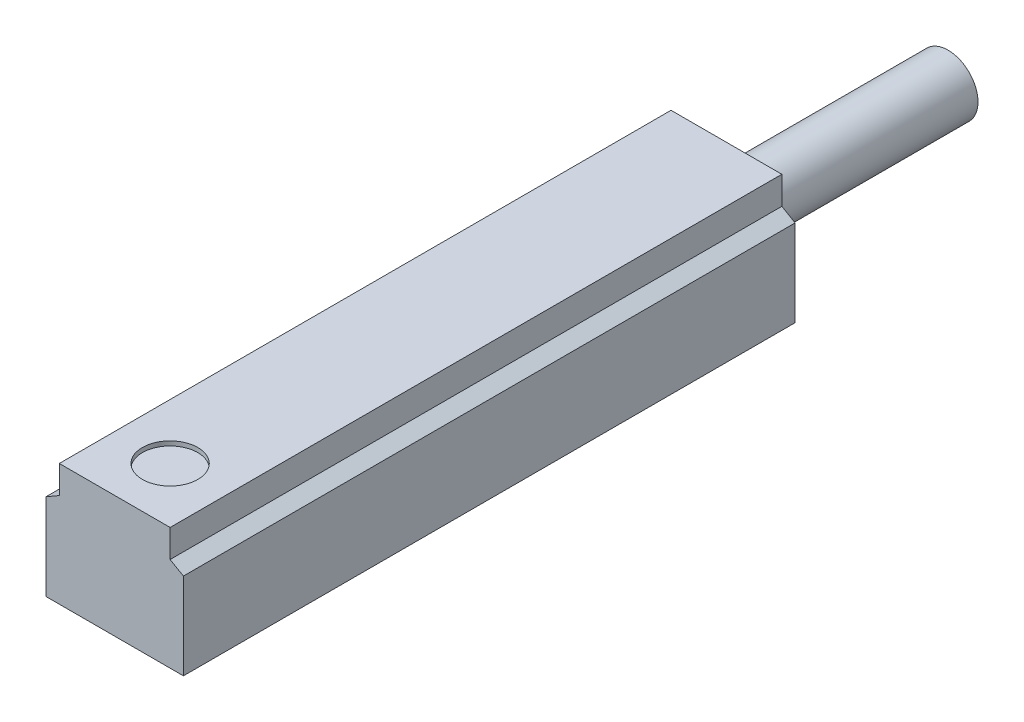
ISO-10303-21;
HEADER;
FILE_DESCRIPTION(('STEP AP214'),'2;1');
FILE_NAME('part.step','',(''),(''),'','','');
FILE_SCHEMA(('AUTOMOTIVE_DESIGN { 1 0 10303 214 1 1 1 1 }'));
ENDSEC;
DATA;
#1=APPLICATION_CONTEXT('core data for automotive mechanical design processes');
#2=APPLICATION_PROTOCOL_DEFINITION('international standard','automotive_design',2000,#1);
#3=PRODUCT_CONTEXT('',#1,'mechanical');
#4=PRODUCT('Part','Part','',(#3));
#5=PRODUCT_RELATED_PRODUCT_CATEGORY('part','',(#4));
#6=PRODUCT_DEFINITION_FORMATION('','',#4);
#7=PRODUCT_DEFINITION_CONTEXT('part definition',#1,'design');
#8=PRODUCT_DEFINITION('design','',#6,#7);
#9=PRODUCT_DEFINITION_SHAPE('','',#8);
#10=(LENGTH_UNIT() NAMED_UNIT(*) SI_UNIT(.MILLI.,.METRE.));
#11=(NAMED_UNIT(*) PLANE_ANGLE_UNIT() SI_UNIT($,.RADIAN.));
#12=(NAMED_UNIT(*) SI_UNIT($,.STERADIAN.) SOLID_ANGLE_UNIT());
#13=UNCERTAINTY_MEASURE_WITH_UNIT(LENGTH_MEASURE(1.E-05),#10,'distance_accuracy_value','');
#14=(GEOMETRIC_REPRESENTATION_CONTEXT(3) GLOBAL_UNCERTAINTY_ASSIGNED_CONTEXT((#13)) GLOBAL_UNIT_ASSIGNED_CONTEXT((#10,
#11,#12)) REPRESENTATION_CONTEXT('',''));
#15=CARTESIAN_POINT('',(0.,0.,0.));
#16=DIRECTION('',(0.,0.,1.));
#17=DIRECTION('',(1.,0.,0.));
#18=AXIS2_PLACEMENT_3D('',#15,#16,#17);
#19=CARTESIAN_POINT('',(2.5,5.5,-27.6));
#20=DIRECTION('',(0.,1.,0.));
#21=DIRECTION('',(0.,0.,1.));
#22=AXIS2_PLACEMENT_3D('',#19,#20,#21);
#23=PLANE('',#22);
#24=DIRECTION('',(-1.,0.,0.));
#25=VECTOR('',#24,1.);
#26=CARTESIAN_POINT('',(2.5,5.5,0.));
#27=LINE('',#26,#25);
#28=CARTESIAN_POINT('',(2.5,5.5,0.));
#29=VERTEX_POINT('',#28);
#30=CARTESIAN_POINT('',(-2.5,5.5,0.));
#31=VERTEX_POINT('',#30);
#32=EDGE_CURVE('E152',#29,#31,#27,.T.);
#33=ORIENTED_EDGE('',*,*,#32,.F.);
#34=DIRECTION('',(0.,0.,1.));
#35=VECTOR('',#34,1.);
#36=CARTESIAN_POINT('',(2.5,5.5,-27.6));
#37=LINE('',#36,#35);
#38=CARTESIAN_POINT('',(2.5,5.5,-27.6));
#39=VERTEX_POINT('',#38);
#40=EDGE_CURVE('E117',#39,#29,#37,.T.);
#41=ORIENTED_EDGE('',*,*,#40,.F.);
#42=DIRECTION('',(-1.,0.,0.));
#43=VECTOR('',#42,1.);
#44=CARTESIAN_POINT('',(2.5,5.5,-27.6));
#45=LINE('',#44,#43);
#46=CARTESIAN_POINT('',(-2.5,5.5,-27.6));
#47=VERTEX_POINT('',#46);
#48=EDGE_CURVE('E124',#39,#47,#45,.T.);
#49=ORIENTED_EDGE('',*,*,#48,.T.);
#50=DIRECTION('',(0.,0.,1.));
#51=VECTOR('',#50,1.);
#52=CARTESIAN_POINT('',(-2.5,5.5,-27.6));
#53=LINE('',#52,#51);
#54=EDGE_CURVE('E107',#47,#31,#53,.T.);
#55=ORIENTED_EDGE('',*,*,#54,.T.);
#56=EDGE_LOOP('',(#33,#41,#49,#55));
#57=FACE_BOUND('',#56,.T.);
#58=CARTESIAN_POINT('',(0.,5.5,-2.5));
#59=DIRECTION('',(0.,1.,0.));
#60=DIRECTION('',(0.,0.,1.));
#61=AXIS2_PLACEMENT_3D('',#58,#59,#60);
#62=CIRCLE('',#61,1.25);
#63=CARTESIAN_POINT('',(0.,5.5,-1.25));
#64=VERTEX_POINT('',#63);
#65=EDGE_CURVE('E226',#64,#64,#62,.T.);
#66=ORIENTED_EDGE('',*,*,#65,.F.);
#67=EDGE_LOOP('',(#66));
#68=FACE_BOUND('',#67,.T.);
#69=ADVANCED_FACE('F36',(#57,#68),#23,.T.);
#70=CARTESIAN_POINT('',(0.,0.,-27.6));
#71=DIRECTION('',(0.,0.,1.));
#72=DIRECTION('',(1.,0.,0.));
#73=AXIS2_PLACEMENT_3D('',#70,#71,#72);
#74=PLANE('',#73);
#75=DIRECTION('',(0.,-1.,0.));
#76=VECTOR('',#75,1.);
#77=CARTESIAN_POINT('',(-3.1,3.9,-27.6));
#78=LINE('',#77,#76);
#79=CARTESIAN_POINT('',(-3.1,3.9,-27.6));
#80=VERTEX_POINT('',#79);
#81=CARTESIAN_POINT('',(-3.1,0.,-27.6));
#82=VERTEX_POINT('',#81);
#83=EDGE_CURVE('E158',#80,#82,#78,.T.);
#84=ORIENTED_EDGE('',*,*,#83,.F.);
#85=DIRECTION('',(-0.866025403784436,-0.500000000000004,0.));
#86=VECTOR('',#85,1.);
#87=CARTESIAN_POINT('',(-2.5,4.24641016151378,-27.6));
#88=LINE('',#87,#86);
#89=CARTESIAN_POINT('',(-2.5,4.24641016151378,-27.6));
#90=VERTEX_POINT('',#89);
#91=EDGE_CURVE('E126',#90,#80,#88,.T.);
#92=ORIENTED_EDGE('',*,*,#91,.F.);
#93=DIRECTION('',(0.,-1.,0.));
#94=VECTOR('',#93,1.);
#95=CARTESIAN_POINT('',(-2.5,5.5,-27.6));
#96=LINE('',#95,#94);
#97=EDGE_CURVE('E110',#47,#90,#96,.T.);
#98=ORIENTED_EDGE('',*,*,#97,.F.);
#99=ORIENTED_EDGE('',*,*,#48,.F.);
#100=DIRECTION('',(0.,1.,0.));
#101=VECTOR('',#100,1.);
#102=CARTESIAN_POINT('',(2.5,4.24641016151378,-27.6));
#103=LINE('',#102,#101);
#104=CARTESIAN_POINT('',(2.5,4.24641016151378,-27.6));
#105=VERTEX_POINT('',#104);
#106=EDGE_CURVE('E129',#105,#39,#103,.T.);
#107=ORIENTED_EDGE('',*,*,#106,.F.);
#108=DIRECTION('',(-0.866025403784436,0.500000000000004,0.));
#109=VECTOR('',#108,1.);
#110=CARTESIAN_POINT('',(3.1,3.9,-27.6));
#111=LINE('',#110,#109);
#112=CARTESIAN_POINT('',(3.1,3.9,-27.6));
#113=VERTEX_POINT('',#112);
#114=EDGE_CURVE('E131',#113,#105,#111,.T.);
#115=ORIENTED_EDGE('',*,*,#114,.F.);
#116=DIRECTION('',(0.,1.,0.));
#117=VECTOR('',#116,1.);
#118=CARTESIAN_POINT('',(3.1,0.,-27.6));
#119=LINE('',#118,#117);
#120=CARTESIAN_POINT('',(3.1,0.,-27.6));
#121=VERTEX_POINT('',#120);
#122=EDGE_CURVE('E236',#121,#113,#119,.T.);
#123=ORIENTED_EDGE('',*,*,#122,.F.);
#124=DIRECTION('',(1.,0.,0.));
#125=VECTOR('',#124,1.);
#126=CARTESIAN_POINT('',(-3.1,0.,-27.6));
#127=LINE('',#126,#125);
#128=EDGE_CURVE('E234',#82,#121,#127,.T.);
#129=ORIENTED_EDGE('',*,*,#128,.F.);
#130=EDGE_LOOP('',(#84,#92,#98,#99,#107,#115,#123,#129));
#131=FACE_BOUND('',#130,.T.);
#132=CARTESIAN_POINT('',(0.,2.75,-27.6));
#133=DIRECTION('',(0.,0.,1.));
#134=DIRECTION('',(1.,0.,0.));
#135=AXIS2_PLACEMENT_3D('',#132,#133,#134);
#136=CIRCLE('',#135,1.35);
#137=CARTESIAN_POINT('',(1.35,2.75,-27.6));
#138=VERTEX_POINT('',#137);
#139=EDGE_CURVE('E11',#138,#138,#136,.F.);
#140=ORIENTED_EDGE('',*,*,#139,.F.);
#141=EDGE_LOOP('',(#140));
#142=FACE_BOUND('',#141,.T.);
#143=ADVANCED_FACE('F121',(#131,#142),#74,.F.);
#144=CARTESIAN_POINT('',(-3.1,3.9,-27.6));
#145=DIRECTION('',(-1.,0.,0.));
#146=DIRECTION('',(0.,0.,1.));
#147=AXIS2_PLACEMENT_3D('',#144,#145,#146);
#148=PLANE('',#147);
#149=DIRECTION('',(0.,-1.,0.));
#150=VECTOR('',#149,1.);
#151=CARTESIAN_POINT('',(-3.1,3.9,0.));
#152=LINE('',#151,#150);
#153=CARTESIAN_POINT('',(-3.1,3.9,0.));
#154=VERTEX_POINT('',#153);
#155=CARTESIAN_POINT('',(-3.1,0.,0.));
#156=VERTEX_POINT('',#155);
#157=EDGE_CURVE('E136',#154,#156,#152,.T.);
#158=ORIENTED_EDGE('',*,*,#157,.F.);
#159=DIRECTION('',(0.,0.,1.));
#160=VECTOR('',#159,1.);
#161=CARTESIAN_POINT('',(-3.1,3.9,-27.6));
#162=LINE('',#161,#160);
#163=EDGE_CURVE('E45',#80,#154,#162,.T.);
#164=ORIENTED_EDGE('',*,*,#163,.F.);
#165=ORIENTED_EDGE('',*,*,#83,.T.);
#166=DIRECTION('',(0.,0.,1.));
#167=VECTOR('',#166,1.);
#168=CARTESIAN_POINT('',(-3.1,0.,-27.6));
#169=LINE('',#168,#167);
#170=EDGE_CURVE('E93',#82,#156,#169,.T.);
#171=ORIENTED_EDGE('',*,*,#170,.T.);
#172=EDGE_LOOP('',(#158,#164,#165,#171));
#173=FACE_BOUND('',#172,.T.);
#174=ADVANCED_FACE('F38',(#173),#148,.T.);
#175=CARTESIAN_POINT('',(-2.5,4.24641016151378,-27.6));
#176=DIRECTION('',(-0.500000000000004,0.866025403784436,0.));
#177=DIRECTION('',(-0.866025403784436,-0.500000000000004,0.));
#178=AXIS2_PLACEMENT_3D('',#175,#176,#177);
#179=PLANE('',#178);
#180=DIRECTION('',(-0.866025403784436,-0.500000000000004,0.));
#181=VECTOR('',#180,1.);
#182=CARTESIAN_POINT('',(-2.5,4.24641016151378,0.));
#183=LINE('',#182,#181);
#184=CARTESIAN_POINT('',(-2.5,4.24641016151378,0.));
#185=VERTEX_POINT('',#184);
#186=EDGE_CURVE('E155',#185,#154,#183,.T.);
#187=ORIENTED_EDGE('',*,*,#186,.F.);
#188=DIRECTION('',(0.,0.,1.));
#189=VECTOR('',#188,1.);
#190=CARTESIAN_POINT('',(-2.5,4.24641016151378,-27.6));
#191=LINE('',#190,#189);
#192=EDGE_CURVE('E81',#90,#185,#191,.T.);
#193=ORIENTED_EDGE('',*,*,#192,.F.);
#194=ORIENTED_EDGE('',*,*,#91,.T.);
#195=ORIENTED_EDGE('',*,*,#163,.T.);
#196=EDGE_LOOP('',(#187,#193,#194,#195));
#197=FACE_BOUND('',#196,.T.);
#198=ADVANCED_FACE('F171',(#197),#179,.T.);
#199=CARTESIAN_POINT('',(-2.5,5.5,-27.6));
#200=DIRECTION('',(-1.,0.,0.));
#201=DIRECTION('',(0.,0.,1.));
#202=AXIS2_PLACEMENT_3D('',#199,#200,#201);
#203=PLANE('',#202);
#204=DIRECTION('',(0.,-1.,0.));
#205=VECTOR('',#204,1.);
#206=CARTESIAN_POINT('',(-2.5,5.5,0.));
#207=LINE('',#206,#205);
#208=EDGE_CURVE('E112',#31,#185,#207,.T.);
#209=ORIENTED_EDGE('',*,*,#208,.F.);
#210=ORIENTED_EDGE('',*,*,#54,.F.);
#211=ORIENTED_EDGE('',*,*,#97,.T.);
#212=ORIENTED_EDGE('',*,*,#192,.T.);
#213=EDGE_LOOP('',(#209,#210,#211,#212));
#214=FACE_BOUND('',#213,.T.);
#215=ADVANCED_FACE('F109',(#214),#203,.T.);
#216=CARTESIAN_POINT('',(2.5,4.24641016151378,-27.6));
#217=DIRECTION('',(1.,0.,0.));
#218=DIRECTION('',(0.,1.,0.));
#219=AXIS2_PLACEMENT_3D('',#216,#217,#218);
#220=PLANE('',#219);
#221=DIRECTION('',(0.,1.,0.));
#222=VECTOR('',#221,1.);
#223=CARTESIAN_POINT('',(2.5,4.24641016151378,0.));
#224=LINE('',#223,#222);
#225=CARTESIAN_POINT('',(2.5,4.24641016151378,0.));
#226=VERTEX_POINT('',#225);
#227=EDGE_CURVE('E149',#226,#29,#224,.T.);
#228=ORIENTED_EDGE('',*,*,#227,.F.);
#229=DIRECTION('',(0.,0.,1.));
#230=VECTOR('',#229,1.);
#231=CARTESIAN_POINT('',(2.5,4.24641016151378,-27.6));
#232=LINE('',#231,#230);
#233=EDGE_CURVE('E162',#105,#226,#232,.T.);
#234=ORIENTED_EDGE('',*,*,#233,.F.);
#235=ORIENTED_EDGE('',*,*,#106,.T.);
#236=ORIENTED_EDGE('',*,*,#40,.T.);
#237=EDGE_LOOP('',(#228,#234,#235,#236));
#238=FACE_BOUND('',#237,.T.);
#239=ADVANCED_FACE('F178',(#238),#220,.T.);
#240=CARTESIAN_POINT('',(3.1,3.9,-27.6));
#241=DIRECTION('',(0.500000000000004,0.866025403784436,0.));
#242=DIRECTION('',(-0.866025403784436,0.500000000000005,0.));
#243=AXIS2_PLACEMENT_3D('',#240,#241,#242);
#244=PLANE('',#243);
#245=DIRECTION('',(-0.866025403784436,0.500000000000004,0.));
#246=VECTOR('',#245,1.);
#247=CARTESIAN_POINT('',(3.1,3.9,0.));
#248=LINE('',#247,#246);
#249=CARTESIAN_POINT('',(3.1,3.9,0.));
#250=VERTEX_POINT('',#249);
#251=EDGE_CURVE('E146',#250,#226,#248,.T.);
#252=ORIENTED_EDGE('',*,*,#251,.F.);
#253=DIRECTION('',(0.,0.,1.));
#254=VECTOR('',#253,1.);
#255=CARTESIAN_POINT('',(3.1,3.9,-27.6));
#256=LINE('',#255,#254);
#257=EDGE_CURVE('E164',#113,#250,#256,.T.);
#258=ORIENTED_EDGE('',*,*,#257,.F.);
#259=ORIENTED_EDGE('',*,*,#114,.T.);
#260=ORIENTED_EDGE('',*,*,#233,.T.);
#261=EDGE_LOOP('',(#252,#258,#259,#260));
#262=FACE_BOUND('',#261,.T.);
#263=ADVANCED_FACE('F190',(#262),#244,.T.);
#264=CARTESIAN_POINT('',(3.1,0.,-27.6));
#265=DIRECTION('',(1.,0.,0.));
#266=DIRECTION('',(0.,0.,-1.));
#267=AXIS2_PLACEMENT_3D('',#264,#265,#266);
#268=PLANE('',#267);
#269=DIRECTION('',(0.,1.,0.));
#270=VECTOR('',#269,1.);
#271=CARTESIAN_POINT('',(3.1,0.,0.));
#272=LINE('',#271,#270);
#273=CARTESIAN_POINT('',(3.1,0.,0.));
#274=VERTEX_POINT('',#273);
#275=EDGE_CURVE('E143',#274,#250,#272,.T.);
#276=ORIENTED_EDGE('',*,*,#275,.F.);
#277=DIRECTION('',(0.,0.,1.));
#278=VECTOR('',#277,1.);
#279=CARTESIAN_POINT('',(3.1,0.,-27.6));
#280=LINE('',#279,#278);
#281=EDGE_CURVE('E166',#121,#274,#280,.T.);
#282=ORIENTED_EDGE('',*,*,#281,.F.);
#283=ORIENTED_EDGE('',*,*,#122,.T.);
#284=ORIENTED_EDGE('',*,*,#257,.T.);
#285=EDGE_LOOP('',(#276,#282,#283,#284));
#286=FACE_BOUND('',#285,.T.);
#287=ADVANCED_FACE('F194',(#286),#268,.T.);
#288=CARTESIAN_POINT('',(-3.1,0.,-27.6));
#289=DIRECTION('',(0.,-1.,0.));
#290=DIRECTION('',(0.,0.,-1.));
#291=AXIS2_PLACEMENT_3D('',#288,#289,#290);
#292=PLANE('',#291);
#293=DIRECTION('',(1.,0.,0.));
#294=VECTOR('',#293,1.);
#295=CARTESIAN_POINT('',(-3.1,0.,0.));
#296=LINE('',#295,#294);
#297=EDGE_CURVE('E139',#156,#274,#296,.T.);
#298=ORIENTED_EDGE('',*,*,#297,.F.);
#299=ORIENTED_EDGE('',*,*,#170,.F.);
#300=ORIENTED_EDGE('',*,*,#128,.T.);
#301=ORIENTED_EDGE('',*,*,#281,.T.);
#302=EDGE_LOOP('',(#298,#299,#300,#301));
#303=FACE_BOUND('',#302,.T.);
#304=ADVANCED_FACE('F167',(#303),#292,.T.);
#305=CARTESIAN_POINT('',(0.,0.,0.));
#306=DIRECTION('',(0.,0.,1.));
#307=DIRECTION('',(1.,0.,0.));
#308=AXIS2_PLACEMENT_3D('',#305,#306,#307);
#309=PLANE('',#308);
#310=ORIENTED_EDGE('',*,*,#157,.T.);
#311=ORIENTED_EDGE('',*,*,#297,.T.);
#312=ORIENTED_EDGE('',*,*,#275,.T.);
#313=ORIENTED_EDGE('',*,*,#251,.T.);
#314=ORIENTED_EDGE('',*,*,#227,.T.);
#315=ORIENTED_EDGE('',*,*,#32,.T.);
#316=ORIENTED_EDGE('',*,*,#208,.T.);
#317=ORIENTED_EDGE('',*,*,#186,.T.);
#318=EDGE_LOOP('',(#310,#311,#312,#313,#314,#315,#316,#317));
#319=FACE_BOUND('',#318,.T.);
#320=ADVANCED_FACE('F170',(#319),#309,.T.);
#321=CARTESIAN_POINT('',(0.,2.75,-37.6));
#322=DIRECTION('',(0.,0.,1.));
#323=DIRECTION('',(1.,0.,0.));
#324=AXIS2_PLACEMENT_3D('',#321,#322,#323);
#325=CYLINDRICAL_SURFACE('',#324,1.35);
#326=ORIENTED_EDGE('',*,*,#139,.T.);
#327=EDGE_LOOP('',(#326));
#328=FACE_BOUND('',#327,.T.);
#329=CARTESIAN_POINT('',(0.,2.75,-37.6));
#330=DIRECTION('',(0.,0.,1.));
#331=DIRECTION('',(1.,0.,0.));
#332=AXIS2_PLACEMENT_3D('',#329,#330,#331);
#333=CIRCLE('',#332,1.35);
#334=CARTESIAN_POINT('',(1.35,2.75,-37.6));
#335=VERTEX_POINT('',#334);
#336=EDGE_CURVE('E140',#335,#335,#333,.T.);
#337=ORIENTED_EDGE('',*,*,#336,.T.);
#338=EDGE_LOOP('',(#337));
#339=FACE_BOUND('',#338,.T.);
#340=ADVANCED_FACE('F202',(#328,#339),#325,.T.);
#341=CARTESIAN_POINT('',(0.,4.1,-37.6));
#342=DIRECTION('',(0.,0.,1.));
#343=DIRECTION('',(1.,0.,0.));
#344=AXIS2_PLACEMENT_3D('',#341,#342,#343);
#345=PLANE('',#344);
#346=ORIENTED_EDGE('',*,*,#336,.F.);
#347=EDGE_LOOP('',(#346));
#348=FACE_BOUND('',#347,.T.);
#349=ADVANCED_FACE('F206',(#348),#345,.F.);
#350=CARTESIAN_POINT('',(0.,5.3,-2.5));
#351=DIRECTION('',(0.,1.,0.));
#352=DIRECTION('',(0.,0.,1.));
#353=AXIS2_PLACEMENT_3D('',#350,#351,#352);
#354=CYLINDRICAL_SURFACE('',#353,1.25);
#355=ORIENTED_EDGE('',*,*,#65,.T.);
#356=EDGE_LOOP('',(#355));
#357=FACE_BOUND('',#356,.T.);
#358=CARTESIAN_POINT('',(0.,5.3,-2.5));
#359=DIRECTION('',(0.,1.,0.));
#360=DIRECTION('',(0.,0.,1.));
#361=AXIS2_PLACEMENT_3D('',#358,#359,#360);
#362=CIRCLE('',#361,1.25);
#363=CARTESIAN_POINT('',(0.,5.3,-1.25));
#364=VERTEX_POINT('',#363);
#365=EDGE_CURVE('E224',#364,#364,#362,.T.);
#366=ORIENTED_EDGE('',*,*,#365,.F.);
#367=EDGE_LOOP('',(#366));
#368=FACE_BOUND('',#367,.T.);
#369=ADVANCED_FACE('F212',(#357,#368),#354,.F.);
#370=CARTESIAN_POINT('',(0.,5.3,-3.75));
#371=DIRECTION('',(0.,1.,0.));
#372=DIRECTION('',(0.,0.,1.));
#373=AXIS2_PLACEMENT_3D('',#370,#371,#372);
#374=PLANE('',#373);
#375=ORIENTED_EDGE('',*,*,#365,.T.);
#376=EDGE_LOOP('',(#375));
#377=FACE_BOUND('',#376,.T.);
#378=ADVANCED_FACE('F216',(#377),#374,.T.);
#379=CLOSED_SHELL('',(#69,#143,#174,#198,#215,#239,#263,#287,#304,#320,#340,#349,#369,#378));
#380=MANIFOLD_SOLID_BREP('B2',#379);
#381=ADVANCED_BREP_SHAPE_REPRESENTATION('',(#18,#380),#14);
#382=SHAPE_DEFINITION_REPRESENTATION(#9,#381);
ENDSEC;
END-ISO-10303-21;
